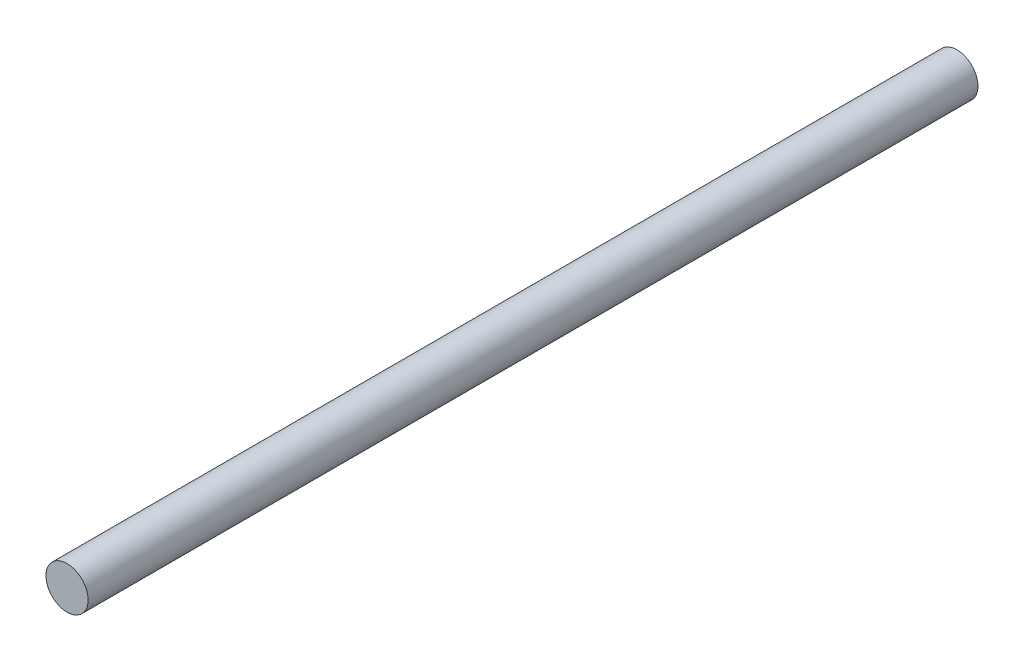
ISO-10303-21;
HEADER;
FILE_DESCRIPTION(('STEP AP214'),'2;1');
FILE_NAME('part.step','',(''),(''),'','','');
FILE_SCHEMA(('AUTOMOTIVE_DESIGN { 1 0 10303 214 1 1 1 1 }'));
ENDSEC;
DATA;
#1=APPLICATION_CONTEXT('core data for automotive mechanical design processes');
#2=APPLICATION_PROTOCOL_DEFINITION('international standard','automotive_design',2000,#1);
#3=PRODUCT_CONTEXT('',#1,'mechanical');
#4=PRODUCT('Part','Part','',(#3));
#5=PRODUCT_RELATED_PRODUCT_CATEGORY('part','',(#4));
#6=PRODUCT_DEFINITION_FORMATION('','',#4);
#7=PRODUCT_DEFINITION_CONTEXT('part definition',#1,'design');
#8=PRODUCT_DEFINITION('design','',#6,#7);
#9=PRODUCT_DEFINITION_SHAPE('','',#8);
#10=(LENGTH_UNIT() NAMED_UNIT(*) SI_UNIT(.MILLI.,.METRE.));
#11=(NAMED_UNIT(*) PLANE_ANGLE_UNIT() SI_UNIT($,.RADIAN.));
#12=(NAMED_UNIT(*) SI_UNIT($,.STERADIAN.) SOLID_ANGLE_UNIT());
#13=UNCERTAINTY_MEASURE_WITH_UNIT(LENGTH_MEASURE(1.E-05),#10,'distance_accuracy_value','');
#14=(GEOMETRIC_REPRESENTATION_CONTEXT(3) GLOBAL_UNCERTAINTY_ASSIGNED_CONTEXT((#13)) GLOBAL_UNIT_ASSIGNED_CONTEXT((#10,
#11,#12)) REPRESENTATION_CONTEXT('',''));
#15=CARTESIAN_POINT('',(0.,0.,0.));
#16=DIRECTION('',(0.,0.,1.));
#17=DIRECTION('',(1.,0.,0.));
#18=AXIS2_PLACEMENT_3D('',#15,#16,#17);
#19=CARTESIAN_POINT('',(0.,0.,96.52));
#20=DIRECTION('',(0.,0.,-1.));
#21=DIRECTION('',(-1.,0.,0.));
#22=AXIS2_PLACEMENT_3D('',#19,#20,#21);
#23=CYLINDRICAL_SURFACE('',#22,2.286);
#24=CARTESIAN_POINT('',(0.,0.,96.52));
#25=DIRECTION('',(0.,0.,1.));
#26=DIRECTION('',(1.,0.,0.));
#27=AXIS2_PLACEMENT_3D('',#24,#25,#26);
#28=CIRCLE('',#27,2.286);
#29=CARTESIAN_POINT('',(2.286,0.,96.52));
#30=VERTEX_POINT('',#29);
#31=EDGE_CURVE('E10',#30,#30,#28,.T.);
#32=ORIENTED_EDGE('',*,*,#31,.F.);
#33=EDGE_LOOP('',(#32));
#34=FACE_BOUND('',#33,.T.);
#35=CARTESIAN_POINT('',(0.,0.,0.));
#36=DIRECTION('',(0.,0.,1.));
#37=DIRECTION('',(1.,0.,0.));
#38=AXIS2_PLACEMENT_3D('',#35,#36,#37);
#39=CIRCLE('',#38,2.286);
#40=CARTESIAN_POINT('',(2.286,0.,0.));
#41=VERTEX_POINT('',#40);
#42=EDGE_CURVE('E44',#41,#41,#39,.T.);
#43=ORIENTED_EDGE('',*,*,#42,.T.);
#44=EDGE_LOOP('',(#43));
#45=FACE_BOUND('',#44,.T.);
#46=ADVANCED_FACE('F41',(#34,#45),#23,.T.);
#47=CARTESIAN_POINT('',(0.,0.,96.52));
#48=DIRECTION('',(0.,0.,1.));
#49=DIRECTION('',(1.,0.,0.));
#50=AXIS2_PLACEMENT_3D('',#47,#48,#49);
#51=PLANE('',#50);
#52=ORIENTED_EDGE('',*,*,#31,.T.);
#53=EDGE_LOOP('',(#52));
#54=FACE_BOUND('',#53,.T.);
#55=ADVANCED_FACE('F58',(#54),#51,.T.);
#56=CARTESIAN_POINT('',(0.,0.,0.));
#57=DIRECTION('',(0.,0.,1.));
#58=DIRECTION('',(1.,0.,0.));
#59=AXIS2_PLACEMENT_3D('',#56,#57,#58);
#60=PLANE('',#59);
#61=ORIENTED_EDGE('',*,*,#42,.F.);
#62=EDGE_LOOP('',(#61));
#63=FACE_BOUND('',#62,.T.);
#64=ADVANCED_FACE('F56',(#63),#60,.F.);
#65=CLOSED_SHELL('',(#46,#55,#64));
#66=MANIFOLD_SOLID_BREP('B2',#65);
#67=ADVANCED_BREP_SHAPE_REPRESENTATION('',(#18,#66),#14);
#68=SHAPE_DEFINITION_REPRESENTATION(#9,#67);
ENDSEC;
END-ISO-10303-21;
